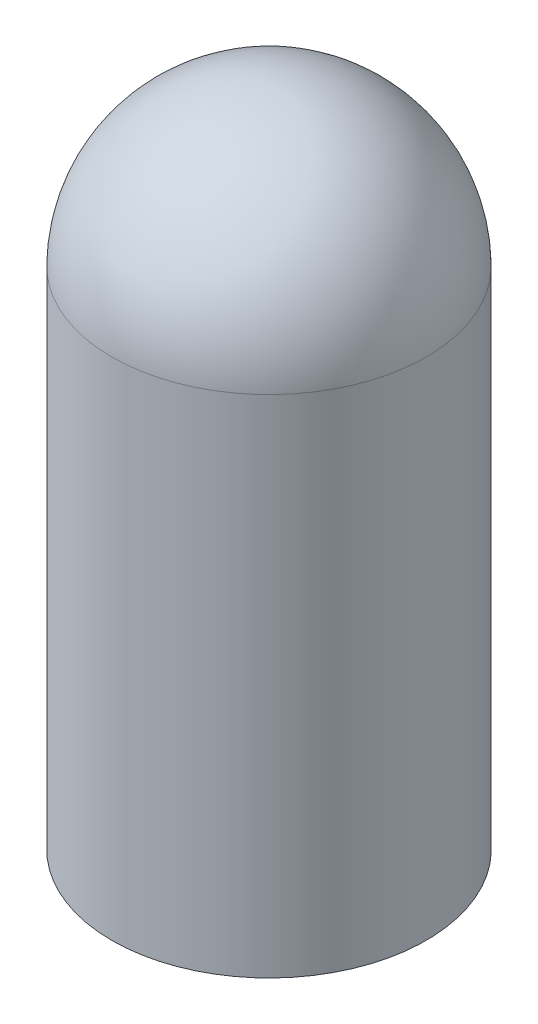
ISO-10303-21;
HEADER;
FILE_DESCRIPTION(('STEP AP214'),'2;1');
FILE_NAME('part.step','',(''),(''),'','','');
FILE_SCHEMA(('AUTOMOTIVE_DESIGN { 1 0 10303 214 1 1 1 1 }'));
ENDSEC;
DATA;
#1=APPLICATION_CONTEXT('core data for automotive mechanical design processes');
#2=APPLICATION_PROTOCOL_DEFINITION('international standard','automotive_design',2000,#1);
#3=PRODUCT_CONTEXT('',#1,'mechanical');
#4=PRODUCT('Part','Part','',(#3));
#5=PRODUCT_RELATED_PRODUCT_CATEGORY('part','',(#4));
#6=PRODUCT_DEFINITION_FORMATION('','',#4);
#7=PRODUCT_DEFINITION_CONTEXT('part definition',#1,'design');
#8=PRODUCT_DEFINITION('design','',#6,#7);
#9=PRODUCT_DEFINITION_SHAPE('','',#8);
#10=(LENGTH_UNIT() NAMED_UNIT(*) SI_UNIT(.MILLI.,.METRE.));
#11=(NAMED_UNIT(*) PLANE_ANGLE_UNIT() SI_UNIT($,.RADIAN.));
#12=(NAMED_UNIT(*) SI_UNIT($,.STERADIAN.) SOLID_ANGLE_UNIT());
#13=UNCERTAINTY_MEASURE_WITH_UNIT(LENGTH_MEASURE(1.E-05),#10,'distance_accuracy_value','');
#14=(GEOMETRIC_REPRESENTATION_CONTEXT(3) GLOBAL_UNCERTAINTY_ASSIGNED_CONTEXT((#13)) GLOBAL_UNIT_ASSIGNED_CONTEXT((#10,
#11,#12)) REPRESENTATION_CONTEXT('',''));
#15=CARTESIAN_POINT('',(0.,0.,0.));
#16=DIRECTION('',(0.,0.,1.));
#17=DIRECTION('',(1.,0.,0.));
#18=AXIS2_PLACEMENT_3D('',#15,#16,#17);
#19=CARTESIAN_POINT('',(0.,165.1,0.));
#20=DIRECTION('',(0.,-1.,0.));
#21=DIRECTION('',(0.,0.,-1.));
#22=AXIS2_PLACEMENT_3D('',#19,#20,#21);
#23=CYLINDRICAL_SURFACE('',#22,51.3588);
#24=CARTESIAN_POINT('',(0.,165.1,0.));
#25=DIRECTION('',(0.,1.,0.));
#26=DIRECTION('',(0.,0.,1.));
#27=AXIS2_PLACEMENT_3D('',#24,#25,#26);
#28=CIRCLE('',#27,51.3588);
#29=CARTESIAN_POINT('',(0.,165.1,51.3588));
#30=VERTEX_POINT('',#29);
#31=EDGE_CURVE('E10',#30,#30,#28,.T.);
#32=ORIENTED_EDGE('',*,*,#31,.F.);
#33=EDGE_LOOP('',(#32));
#34=FACE_BOUND('',#33,.T.);
#35=CARTESIAN_POINT('',(0.,0.,0.));
#36=DIRECTION('',(0.,1.,0.));
#37=DIRECTION('',(0.,0.,1.));
#38=AXIS2_PLACEMENT_3D('',#35,#36,#37);
#39=CIRCLE('',#38,51.3588);
#40=CARTESIAN_POINT('',(0.,0.,51.3588));
#41=VERTEX_POINT('',#40);
#42=EDGE_CURVE('E40',#41,#41,#39,.T.);
#43=ORIENTED_EDGE('',*,*,#42,.T.);
#44=EDGE_LOOP('',(#43));
#45=FACE_BOUND('',#44,.T.);
#46=ADVANCED_FACE('F33',(#34,#45),#23,.T.);
#47=CARTESIAN_POINT('',(0.,164.5381266,0.));
#48=DIRECTION('',(0.,0.,1.));
#49=DIRECTION('',(1.,0.,0.));
#50=AXIS2_PLACEMENT_3D('',#47,#48,#49);
#51=SPHERICAL_SURFACE('',#50,51.3618734);
#52=CARTESIAN_POINT('',(0.,164.5381266,0.));
#53=DIRECTION('',(0.,1.,0.));
#54=DIRECTION('',(0.,0.,1.));
#55=AXIS2_PLACEMENT_3D('',#52,#53,#54);
#56=SPHERICAL_SURFACE('',#55,51.3618734);
#57=ORIENTED_EDGE('',*,*,#31,.T.);
#58=EDGE_LOOP('',(#57));
#59=FACE_BOUND('',#58,.T.);
#60=ADVANCED_FACE('F35',(#59),#56,.T.);
#61=CARTESIAN_POINT('',(0.,0.,0.));
#62=DIRECTION('',(0.,1.,0.));
#63=DIRECTION('',(0.,0.,1.));
#64=AXIS2_PLACEMENT_3D('',#61,#62,#63);
#65=PLANE('',#64);
#66=CARTESIAN_POINT('',(0.,0.,0.));
#67=DIRECTION('',(0.,1.,0.));
#68=DIRECTION('',(0.,0.,1.));
#69=AXIS2_PLACEMENT_3D('',#66,#67,#68);
#70=CIRCLE('',#69,50.8);
#71=CARTESIAN_POINT('',(0.,0.,50.8));
#72=VERTEX_POINT('',#71);
#73=EDGE_CURVE('E48',#72,#72,#70,.T.);
#74=ORIENTED_EDGE('',*,*,#73,.T.);
#75=EDGE_LOOP('',(#74));
#76=FACE_BOUND('',#75,.T.);
#77=ORIENTED_EDGE('',*,*,#42,.F.);
#78=EDGE_LOOP('',(#77));
#79=FACE_BOUND('',#78,.T.);
#80=ADVANCED_FACE('F54',(#76,#79),#65,.F.);
#81=CARTESIAN_POINT('',(0.,165.1,0.));
#82=DIRECTION('',(0.,-1.,0.));
#83=DIRECTION('',(0.,0.,-1.));
#84=AXIS2_PLACEMENT_3D('',#81,#82,#83);
#85=CYLINDRICAL_SURFACE('',#84,50.8);
#86=CARTESIAN_POINT('',(0.,165.096935051786,0.));
#87=DIRECTION('',(0.,-1.00000000000001,0.));
#88=DIRECTION('',(0.,0.,-1.));
#89=AXIS2_PLACEMENT_3D('',#86,#87,#88);
#90=CIRCLE('',#89,50.8);
#91=CARTESIAN_POINT('',(0.,165.096935051786,-50.8));
#92=VERTEX_POINT('',#91);
#93=EDGE_CURVE('E44',#92,#92,#90,.F.);
#94=ORIENTED_EDGE('',*,*,#93,.T.);
#95=EDGE_LOOP('',(#94));
#96=FACE_BOUND('',#95,.T.);
#97=ORIENTED_EDGE('',*,*,#73,.F.);
#98=EDGE_LOOP('',(#97));
#99=FACE_BOUND('',#98,.T.);
#100=ADVANCED_FACE('F57',(#96,#99),#85,.F.);
#101=CARTESIAN_POINT('',(0.,164.5381266,0.));
#102=DIRECTION('',(0.,0.,1.));
#103=DIRECTION('',(1.,0.,0.));
#104=AXIS2_PLACEMENT_3D('',#101,#102,#103);
#105=SPHERICAL_SURFACE('',#104,50.8030734);
#106=CARTESIAN_POINT('',(0.,164.5381266,0.));
#107=DIRECTION('',(0.,-1.,0.));
#108=DIRECTION('',(0.,0.,-1.));
#109=AXIS2_PLACEMENT_3D('',#106,#107,#108);
#110=SPHERICAL_SURFACE('',#109,50.8030734);
#111=ORIENTED_EDGE('',*,*,#93,.F.);
#112=EDGE_LOOP('',(#111));
#113=FACE_BOUND('',#112,.T.);
#114=ADVANCED_FACE('F59',(#113),#110,.F.);
#115=CLOSED_SHELL('',(#46,#60,#80,#100,#114));
#116=MANIFOLD_SOLID_BREP('B2',#115);
#117=ADVANCED_BREP_SHAPE_REPRESENTATION('',(#18,#116),#14);
#118=SHAPE_DEFINITION_REPRESENTATION(#9,#117);
ENDSEC;
END-ISO-10303-21;
